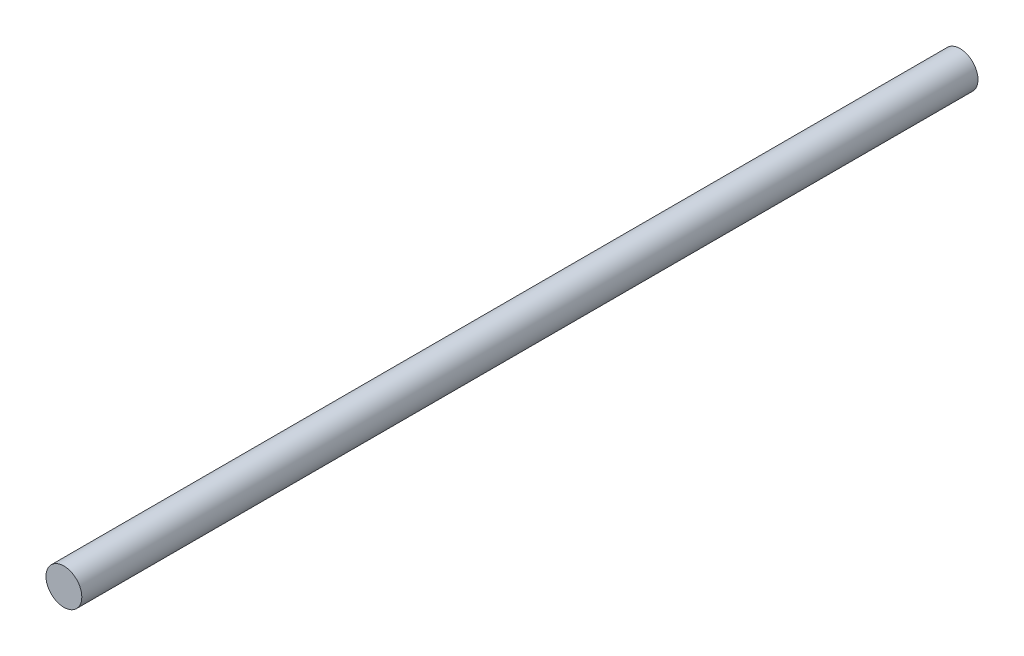
ISO-10303-21;
HEADER;
FILE_DESCRIPTION(('STEP AP214'),'2;1');
FILE_NAME('part.step','',(''),(''),'','','');
FILE_SCHEMA(('AUTOMOTIVE_DESIGN { 1 0 10303 214 1 1 1 1 }'));
ENDSEC;
DATA;
#1=APPLICATION_CONTEXT('core data for automotive mechanical design processes');
#2=APPLICATION_PROTOCOL_DEFINITION('international standard','automotive_design',2000,#1);
#3=PRODUCT_CONTEXT('',#1,'mechanical');
#4=PRODUCT('Part','Part','',(#3));
#5=PRODUCT_RELATED_PRODUCT_CATEGORY('part','',(#4));
#6=PRODUCT_DEFINITION_FORMATION('','',#4);
#7=PRODUCT_DEFINITION_CONTEXT('part definition',#1,'design');
#8=PRODUCT_DEFINITION('design','',#6,#7);
#9=PRODUCT_DEFINITION_SHAPE('','',#8);
#10=(LENGTH_UNIT() NAMED_UNIT(*) SI_UNIT(.MILLI.,.METRE.));
#11=(NAMED_UNIT(*) PLANE_ANGLE_UNIT() SI_UNIT($,.RADIAN.));
#12=(NAMED_UNIT(*) SI_UNIT($,.STERADIAN.) SOLID_ANGLE_UNIT());
#13=UNCERTAINTY_MEASURE_WITH_UNIT(LENGTH_MEASURE(1.E-05),#10,'distance_accuracy_value','');
#14=(GEOMETRIC_REPRESENTATION_CONTEXT(3) GLOBAL_UNCERTAINTY_ASSIGNED_CONTEXT((#13)) GLOBAL_UNIT_ASSIGNED_CONTEXT((#10,
#11,#12)) REPRESENTATION_CONTEXT('',''));
#15=CARTESIAN_POINT('',(0.,0.,0.));
#16=DIRECTION('',(0.,0.,1.));
#17=DIRECTION('',(1.,0.,0.));
#18=AXIS2_PLACEMENT_3D('',#15,#16,#17);
#19=CARTESIAN_POINT('',(-2.6,7.00000000000402,-16.2));
#20=DIRECTION('',(0.,0.,1.));
#21=DIRECTION('',(1.,0.,0.));
#22=AXIS2_PLACEMENT_3D('',#19,#20,#21);
#23=PLANE('',#22);
#24=CARTESIAN_POINT('',(-2.6,7.00000000000402,-16.2));
#25=DIRECTION('',(0.,0.,1.));
#26=DIRECTION('',(-1.,0.,0.));
#27=AXIS2_PLACEMENT_3D('',#24,#25,#26);
#28=CIRCLE('',#27,0.6);
#29=CARTESIAN_POINT('',(-2.,7.00000000000402,-16.2));
#30=VERTEX_POINT('',#29);
#31=EDGE_CURVE('E10',#30,#30,#28,.T.);
#32=ORIENTED_EDGE('',*,*,#31,.F.);
#33=EDGE_LOOP('',(#32));
#34=FACE_BOUND('',#33,.T.);
#35=ADVANCED_FACE('F15',(#34),#23,.F.);
#36=CARTESIAN_POINT('',(-2.6,7.00000000000402,13.8));
#37=DIRECTION('',(0.,0.,1.));
#38=DIRECTION('',(1.,0.,0.));
#39=AXIS2_PLACEMENT_3D('',#36,#37,#38);
#40=PLANE('',#39);
#41=CARTESIAN_POINT('',(-2.6,7.00000000000402,13.8));
#42=DIRECTION('',(0.,0.,1.));
#43=DIRECTION('',(-1.,0.,0.));
#44=AXIS2_PLACEMENT_3D('',#41,#42,#43);
#45=CIRCLE('',#44,0.6);
#46=CARTESIAN_POINT('',(-2.,7.00000000000402,13.8));
#47=VERTEX_POINT('',#46);
#48=EDGE_CURVE('E40',#47,#47,#45,.T.);
#49=ORIENTED_EDGE('',*,*,#48,.T.);
#50=EDGE_LOOP('',(#49));
#51=FACE_BOUND('',#50,.T.);
#52=ADVANCED_FACE('F43',(#51),#40,.T.);
#53=CARTESIAN_POINT('',(-2.6,7.00000000000402,-16.2));
#54=DIRECTION('',(0.,0.,1.));
#55=DIRECTION('',(-1.,0.,0.));
#56=AXIS2_PLACEMENT_3D('',#53,#54,#55);
#57=CYLINDRICAL_SURFACE('',#56,0.6);
#58=ORIENTED_EDGE('',*,*,#48,.F.);
#59=DIRECTION('',(0.,0.,-1.));
#60=VECTOR('',#59,1.);
#61=CARTESIAN_POINT('',(-2.,7.00000000000402,-16.2));
#62=LINE('',#61,#60);
#63=EDGE_CURVE('E19',#47,#30,#62,.T.);
#64=ORIENTED_EDGE('',*,*,#63,.T.);
#65=ORIENTED_EDGE('',*,*,#31,.T.);
#66=ORIENTED_EDGE('',*,*,#63,.F.);
#67=EDGE_LOOP('',(#58,#64,#65,#66));
#68=FACE_BOUND('',#67,.T.);
#69=ADVANCED_FACE('F17',(#68),#57,.T.);
#70=CLOSED_SHELL('',(#35,#52,#69));
#71=MANIFOLD_SOLID_BREP('B1',#70);
#72=ADVANCED_BREP_SHAPE_REPRESENTATION('',(#18,#71),#14);
#73=SHAPE_DEFINITION_REPRESENTATION(#9,#72);
ENDSEC;
END-ISO-10303-21;
